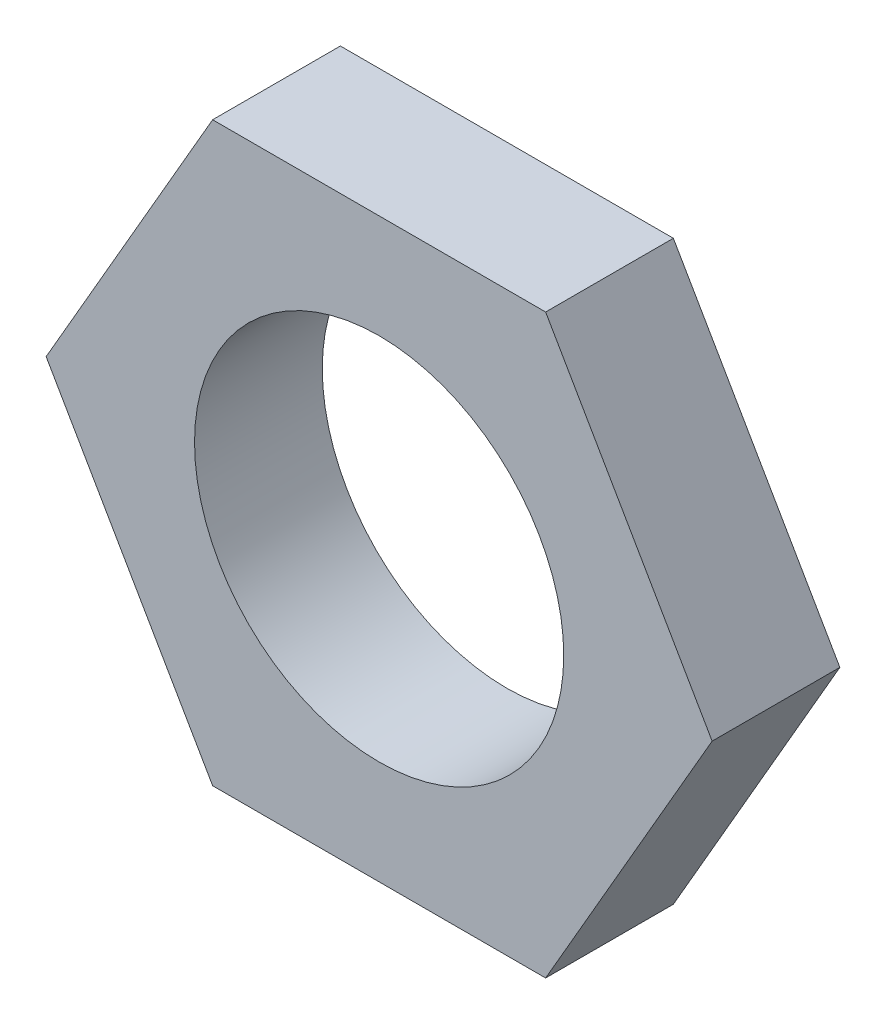
ISO-10303-21;
HEADER;
FILE_DESCRIPTION(('STEP AP214'),'2;1');
FILE_NAME('part.step','',(''),(''),'','','');
FILE_SCHEMA(('AUTOMOTIVE_DESIGN { 1 0 10303 214 1 1 1 1 }'));
ENDSEC;
DATA;
#1=APPLICATION_CONTEXT('core data for automotive mechanical design processes');
#2=APPLICATION_PROTOCOL_DEFINITION('international standard','automotive_design',2000,#1);
#3=PRODUCT_CONTEXT('',#1,'mechanical');
#4=PRODUCT('Part','Part','',(#3));
#5=PRODUCT_RELATED_PRODUCT_CATEGORY('part','',(#4));
#6=PRODUCT_DEFINITION_FORMATION('','',#4);
#7=PRODUCT_DEFINITION_CONTEXT('part definition',#1,'design');
#8=PRODUCT_DEFINITION('design','',#6,#7);
#9=PRODUCT_DEFINITION_SHAPE('','',#8);
#10=(LENGTH_UNIT() NAMED_UNIT(*) SI_UNIT(.MILLI.,.METRE.));
#11=(NAMED_UNIT(*) PLANE_ANGLE_UNIT() SI_UNIT($,.RADIAN.));
#12=(NAMED_UNIT(*) SI_UNIT($,.STERADIAN.) SOLID_ANGLE_UNIT());
#13=UNCERTAINTY_MEASURE_WITH_UNIT(LENGTH_MEASURE(1.E-05),#10,'distance_accuracy_value','');
#14=(GEOMETRIC_REPRESENTATION_CONTEXT(3) GLOBAL_UNCERTAINTY_ASSIGNED_CONTEXT((#13)) GLOBAL_UNIT_ASSIGNED_CONTEXT((#10,
#11,#12)) REPRESENTATION_CONTEXT('',''));
#15=CARTESIAN_POINT('',(0.,0.,0.));
#16=DIRECTION('',(0.,0.,1.));
#17=DIRECTION('',(1.,0.,0.));
#18=AXIS2_PLACEMENT_3D('',#15,#16,#17);
#19=CARTESIAN_POINT('',(1.94289029309402E-13,-3.33066907387547E-13,-3.24999999999998));
#20=DIRECTION('',(0.,0.,1.));
#21=DIRECTION('',(1.,0.,0.));
#22=AXIS2_PLACEMENT_3D('',#19,#20,#21);
#23=PLANE('',#22);
#24=CARTESIAN_POINT('',(0.,0.,-3.24999999999998));
#25=DIRECTION('',(0.,0.,1.));
#26=DIRECTION('',(1.,0.,0.));
#27=AXIS2_PLACEMENT_3D('',#24,#25,#26);
#28=CIRCLE('',#27,9.25);
#29=CARTESIAN_POINT('',(9.25000000000002,0.,-3.24999999999998));
#30=VERTEX_POINT('',#29);
#31=EDGE_CURVE('E19',#30,#30,#28,.T.);
#32=ORIENTED_EDGE('',*,*,#31,.T.);
#33=EDGE_LOOP('',(#32));
#34=FACE_BOUND('',#33,.T.);
#35=DIRECTION('',(-0.5,0.866025403784441,0.));
#36=VECTOR('',#35,1.);
#37=CARTESIAN_POINT('',(8.34285805860779,14.4502540378446,-3.24999999999998));
#38=LINE('',#37,#36);
#39=CARTESIAN_POINT('',(16.6857161172159,0.,-3.24999999999998));
#40=VERTEX_POINT('',#39);
#41=CARTESIAN_POINT('',(8.34285805860779,14.4502540378446,-3.24999999999998));
#42=VERTEX_POINT('',#41);
#43=EDGE_CURVE('E70',#40,#42,#38,.T.);
#44=ORIENTED_EDGE('',*,*,#43,.F.);
#45=DIRECTION('',(0.5,0.866025403784441,0.));
#46=VECTOR('',#45,1.);
#47=CARTESIAN_POINT('',(16.6857161172159,0.,-3.24999999999998));
#48=LINE('',#47,#46);
#49=CARTESIAN_POINT('',(8.34285805860785,-14.4502540378448,-3.24999999999998));
#50=VERTEX_POINT('',#49);
#51=EDGE_CURVE('E104',#50,#40,#48,.T.);
#52=ORIENTED_EDGE('',*,*,#51,.F.);
#53=DIRECTION('',(1.,0.,0.));
#54=VECTOR('',#53,1.);
#55=CARTESIAN_POINT('',(8.34285805860785,-14.4502540378448,-3.24999999999998));
#56=LINE('',#55,#54);
#57=CARTESIAN_POINT('',(-8.34285805860774,-14.4502540378447,-3.24999999999998));
#58=VERTEX_POINT('',#57);
#59=EDGE_CURVE('E101',#58,#50,#56,.T.);
#60=ORIENTED_EDGE('',*,*,#59,.F.);
#61=DIRECTION('',(0.5,-0.866025403784441,0.));
#62=VECTOR('',#61,1.);
#63=CARTESIAN_POINT('',(-8.34285805860782,-14.4502540378446,-3.24999999999998));
#64=LINE('',#63,#62);
#65=CARTESIAN_POINT('',(-16.6857161172158,-1.11022302462516E-13,-3.24999999999998));
#66=VERTEX_POINT('',#65);
#67=EDGE_CURVE('E96',#66,#58,#64,.T.);
#68=ORIENTED_EDGE('',*,*,#67,.F.);
#69=DIRECTION('',(-0.5,-0.866025403784441,0.));
#70=VECTOR('',#69,1.);
#71=CARTESIAN_POINT('',(-16.6857161172158,-1.11022302462516E-13,-3.24999999999998));
#72=LINE('',#71,#70);
#73=CARTESIAN_POINT('',(-8.34285805860777,14.4502540378445,-3.24999999999998));
#74=VERTEX_POINT('',#73);
#75=EDGE_CURVE('E81',#74,#66,#72,.T.);
#76=ORIENTED_EDGE('',*,*,#75,.F.);
#77=DIRECTION('',(1.,0.,0.));
#78=VECTOR('',#77,1.);
#79=CARTESIAN_POINT('',(-8.34285805860777,14.4502540378445,-3.24999999999998));
#80=LINE('',#79,#78);
#81=EDGE_CURVE('E65',#42,#74,#80,.F.);
#82=ORIENTED_EDGE('',*,*,#81,.F.);
#83=EDGE_LOOP('',(#44,#52,#60,#68,#76,#82));
#84=FACE_BOUND('',#83,.T.);
#85=ADVANCED_FACE('F16',(#34,#84),#23,.F.);
#86=CARTESIAN_POINT('',(8.34285805860779,14.4502540378446,-3.24999999999998));
#87=DIRECTION('',(0.866025403784441,0.5,0.));
#88=DIRECTION('',(-0.5,0.866025403784441,0.));
#89=AXIS2_PLACEMENT_3D('',#86,#87,#88);
#90=PLANE('',#89);
#91=ORIENTED_EDGE('',*,*,#43,.T.);
#92=DIRECTION('',(0.,0.,1.));
#93=VECTOR('',#92,1.);
#94=CARTESIAN_POINT('',(8.34285805860779,14.4502540378446,-3.24999999999998));
#95=LINE('',#94,#93);
#96=CARTESIAN_POINT('',(8.34285805860779,14.4502540378446,3.14999999999999));
#97=VERTEX_POINT('',#96);
#98=EDGE_CURVE('E72',#97,#42,#95,.F.);
#99=ORIENTED_EDGE('',*,*,#98,.F.);
#100=DIRECTION('',(-0.5,0.866025403784441,0.));
#101=VECTOR('',#100,1.);
#102=CARTESIAN_POINT('',(16.6857161172159,0.,3.14999999999999));
#103=LINE('',#102,#101);
#104=CARTESIAN_POINT('',(16.6857161172159,0.,3.14999999999999));
#105=VERTEX_POINT('',#104);
#106=EDGE_CURVE('E107',#105,#97,#103,.T.);
#107=ORIENTED_EDGE('',*,*,#106,.F.);
#108=DIRECTION('',(0.,0.,1.));
#109=VECTOR('',#108,1.);
#110=CARTESIAN_POINT('',(16.6857161172159,0.,-3.24999999999998));
#111=LINE('',#110,#109);
#112=EDGE_CURVE('E75',#40,#105,#111,.T.);
#113=ORIENTED_EDGE('',*,*,#112,.F.);
#114=EDGE_LOOP('',(#91,#99,#107,#113));
#115=FACE_BOUND('',#114,.T.);
#116=ADVANCED_FACE('F71',(#115),#90,.T.);
#117=CARTESIAN_POINT('',(-8.34285805860777,14.4502540378445,-3.24999999999998));
#118=DIRECTION('',(0.,1.,0.));
#119=DIRECTION('',(0.,0.,1.));
#120=AXIS2_PLACEMENT_3D('',#117,#118,#119);
#121=PLANE('',#120);
#122=ORIENTED_EDGE('',*,*,#81,.T.);
#123=DIRECTION('',(0.,0.,1.));
#124=VECTOR('',#123,1.);
#125=CARTESIAN_POINT('',(-8.34285805860777,14.4502540378445,-3.24999999999998));
#126=LINE('',#125,#124);
#127=CARTESIAN_POINT('',(-8.34285805860777,14.4502540378445,3.14999999999999));
#128=VERTEX_POINT('',#127);
#129=EDGE_CURVE('E83',#128,#74,#126,.F.);
#130=ORIENTED_EDGE('',*,*,#129,.F.);
#131=DIRECTION('',(1.,0.,0.));
#132=VECTOR('',#131,1.);
#133=CARTESIAN_POINT('',(0.,14.4502540378446,3.14999999999999));
#134=LINE('',#133,#132);
#135=EDGE_CURVE('E87',#97,#128,#134,.F.);
#136=ORIENTED_EDGE('',*,*,#135,.F.);
#137=ORIENTED_EDGE('',*,*,#98,.T.);
#138=EDGE_LOOP('',(#122,#130,#136,#137));
#139=FACE_BOUND('',#138,.T.);
#140=ADVANCED_FACE('F85',(#139),#121,.T.);
#141=CARTESIAN_POINT('',(-16.6857161172158,-1.11022302462516E-13,-3.24999999999998));
#142=DIRECTION('',(-0.866025403784441,0.5,0.));
#143=DIRECTION('',(-0.5,-0.866025403784441,0.));
#144=AXIS2_PLACEMENT_3D('',#141,#142,#143);
#145=PLANE('',#144);
#146=ORIENTED_EDGE('',*,*,#75,.T.);
#147=DIRECTION('',(0.,0.,1.));
#148=VECTOR('',#147,1.);
#149=CARTESIAN_POINT('',(-16.6857161172158,-1.11022302462516E-13,-3.24999999999998));
#150=LINE('',#149,#148);
#151=CARTESIAN_POINT('',(-16.6857161172158,-1.11022302462516E-13,3.14999999999999));
#152=VERTEX_POINT('',#151);
#153=EDGE_CURVE('E93',#152,#66,#150,.F.);
#154=ORIENTED_EDGE('',*,*,#153,.F.);
#155=DIRECTION('',(-0.5,-0.866025403784441,0.));
#156=VECTOR('',#155,1.);
#157=CARTESIAN_POINT('',(-8.34285805860777,14.4502540378445,3.14999999999999));
#158=LINE('',#157,#156);
#159=EDGE_CURVE('E110',#128,#152,#158,.T.);
#160=ORIENTED_EDGE('',*,*,#159,.F.);
#161=ORIENTED_EDGE('',*,*,#129,.T.);
#162=EDGE_LOOP('',(#146,#154,#160,#161));
#163=FACE_BOUND('',#162,.T.);
#164=ADVANCED_FACE('F131',(#163),#145,.T.);
#165=CARTESIAN_POINT('',(-8.34285805860782,-14.4502540378446,-3.24999999999998));
#166=DIRECTION('',(-0.866025403784441,-0.5,0.));
#167=DIRECTION('',(0.5,-0.866025403784441,0.));
#168=AXIS2_PLACEMENT_3D('',#165,#166,#167);
#169=PLANE('',#168);
#170=ORIENTED_EDGE('',*,*,#67,.T.);
#171=DIRECTION('',(0.,0.,-1.));
#172=VECTOR('',#171,1.);
#173=CARTESIAN_POINT('',(-8.34285805860782,-14.4502540378446,-3.24999999999998));
#174=LINE('',#173,#172);
#175=CARTESIAN_POINT('',(-8.34285805860774,-14.4502540378447,3.14999999999999));
#176=VERTEX_POINT('',#175);
#177=EDGE_CURVE('E98',#176,#58,#174,.T.);
#178=ORIENTED_EDGE('',*,*,#177,.F.);
#179=DIRECTION('',(0.5,-0.866025403784441,0.));
#180=VECTOR('',#179,1.);
#181=CARTESIAN_POINT('',(-16.6857161172158,-1.11022302462516E-13,3.14999999999999));
#182=LINE('',#181,#180);
#183=EDGE_CURVE('E113',#152,#176,#182,.T.);
#184=ORIENTED_EDGE('',*,*,#183,.F.);
#185=ORIENTED_EDGE('',*,*,#153,.T.);
#186=EDGE_LOOP('',(#170,#178,#184,#185));
#187=FACE_BOUND('',#186,.T.);
#188=ADVANCED_FACE('F128',(#187),#169,.T.);
#189=CARTESIAN_POINT('',(8.34285805860785,-14.4502540378448,-3.24999999999998));
#190=DIRECTION('',(0.,-1.,0.));
#191=DIRECTION('',(0.,0.,-1.));
#192=AXIS2_PLACEMENT_3D('',#189,#190,#191);
#193=PLANE('',#192);
#194=ORIENTED_EDGE('',*,*,#59,.T.);
#195=DIRECTION('',(0.,0.,1.));
#196=VECTOR('',#195,1.);
#197=CARTESIAN_POINT('',(8.34285805860785,-14.4502540378448,-3.24999999999998));
#198=LINE('',#197,#196);
#199=CARTESIAN_POINT('',(8.34285805860785,-14.4502540378448,3.14999999999999));
#200=VERTEX_POINT('',#199);
#201=EDGE_CURVE('E33',#200,#50,#198,.F.);
#202=ORIENTED_EDGE('',*,*,#201,.F.);
#203=DIRECTION('',(1.,0.,0.));
#204=VECTOR('',#203,1.);
#205=CARTESIAN_POINT('',(1.94289029309402E-13,-14.4502540378447,3.14999999999999));
#206=LINE('',#205,#204);
#207=EDGE_CURVE('E116',#176,#200,#206,.T.);
#208=ORIENTED_EDGE('',*,*,#207,.F.);
#209=ORIENTED_EDGE('',*,*,#177,.T.);
#210=EDGE_LOOP('',(#194,#202,#208,#209));
#211=FACE_BOUND('',#210,.T.);
#212=ADVANCED_FACE('F125',(#211),#193,.T.);
#213=CARTESIAN_POINT('',(16.6857161172159,0.,-3.24999999999998));
#214=DIRECTION('',(0.866025403784441,-0.5,0.));
#215=DIRECTION('',(0.5,0.866025403784441,0.));
#216=AXIS2_PLACEMENT_3D('',#213,#214,#215);
#217=PLANE('',#216);
#218=ORIENTED_EDGE('',*,*,#51,.T.);
#219=ORIENTED_EDGE('',*,*,#112,.T.);
#220=DIRECTION('',(0.5,0.866025403784441,0.));
#221=VECTOR('',#220,1.);
#222=CARTESIAN_POINT('',(8.34285805860785,-14.4502540378448,3.14999999999999));
#223=LINE('',#222,#221);
#224=EDGE_CURVE('E25',#200,#105,#223,.T.);
#225=ORIENTED_EDGE('',*,*,#224,.F.);
#226=ORIENTED_EDGE('',*,*,#201,.T.);
#227=EDGE_LOOP('',(#218,#219,#225,#226));
#228=FACE_BOUND('',#227,.T.);
#229=ADVANCED_FACE('F123',(#228),#217,.T.);
#230=CARTESIAN_POINT('',(0.,0.,-3.24999999999998));
#231=DIRECTION('',(0.,0.,1.));
#232=DIRECTION('',(1.,0.,0.));
#233=AXIS2_PLACEMENT_3D('',#230,#231,#232);
#234=CYLINDRICAL_SURFACE('',#233,9.25);
#235=ORIENTED_EDGE('',*,*,#31,.F.);
#236=EDGE_LOOP('',(#235));
#237=FACE_BOUND('',#236,.T.);
#238=CARTESIAN_POINT('',(0.,0.,3.14999999999999));
#239=DIRECTION('',(0.,0.,1.));
#240=DIRECTION('',(1.,0.,0.));
#241=AXIS2_PLACEMENT_3D('',#238,#239,#240);
#242=CIRCLE('',#241,9.25);
#243=CARTESIAN_POINT('',(9.25000000000002,0.,3.14999999999999));
#244=VERTEX_POINT('',#243);
#245=EDGE_CURVE('E11',#244,#244,#242,.F.);
#246=ORIENTED_EDGE('',*,*,#245,.F.);
#247=EDGE_LOOP('',(#246));
#248=FACE_BOUND('',#247,.T.);
#249=ADVANCED_FACE('F142',(#237,#248),#234,.F.);
#250=CARTESIAN_POINT('',(1.94289029309402E-13,-3.33066907387547E-13,3.14999999999999));
#251=DIRECTION('',(0.,0.,1.));
#252=DIRECTION('',(1.,0.,0.));
#253=AXIS2_PLACEMENT_3D('',#250,#251,#252);
#254=PLANE('',#253);
#255=ORIENTED_EDGE('',*,*,#245,.T.);
#256=EDGE_LOOP('',(#255));
#257=FACE_BOUND('',#256,.T.);
#258=ORIENTED_EDGE('',*,*,#207,.T.);
#259=ORIENTED_EDGE('',*,*,#224,.T.);
#260=ORIENTED_EDGE('',*,*,#106,.T.);
#261=ORIENTED_EDGE('',*,*,#135,.T.);
#262=ORIENTED_EDGE('',*,*,#159,.T.);
#263=ORIENTED_EDGE('',*,*,#183,.T.);
#264=EDGE_LOOP('',(#258,#259,#260,#261,#262,#263));
#265=FACE_BOUND('',#264,.T.);
#266=ADVANCED_FACE('F121',(#257,#265),#254,.T.);
#267=CLOSED_SHELL('',(#85,#116,#140,#164,#188,#212,#229,#249,#266));
#268=MANIFOLD_SOLID_BREP('B1',#267);
#269=ADVANCED_BREP_SHAPE_REPRESENTATION('',(#18,#268),#14);
#270=SHAPE_DEFINITION_REPRESENTATION(#9,#269);
ENDSEC;
END-ISO-10303-21;
